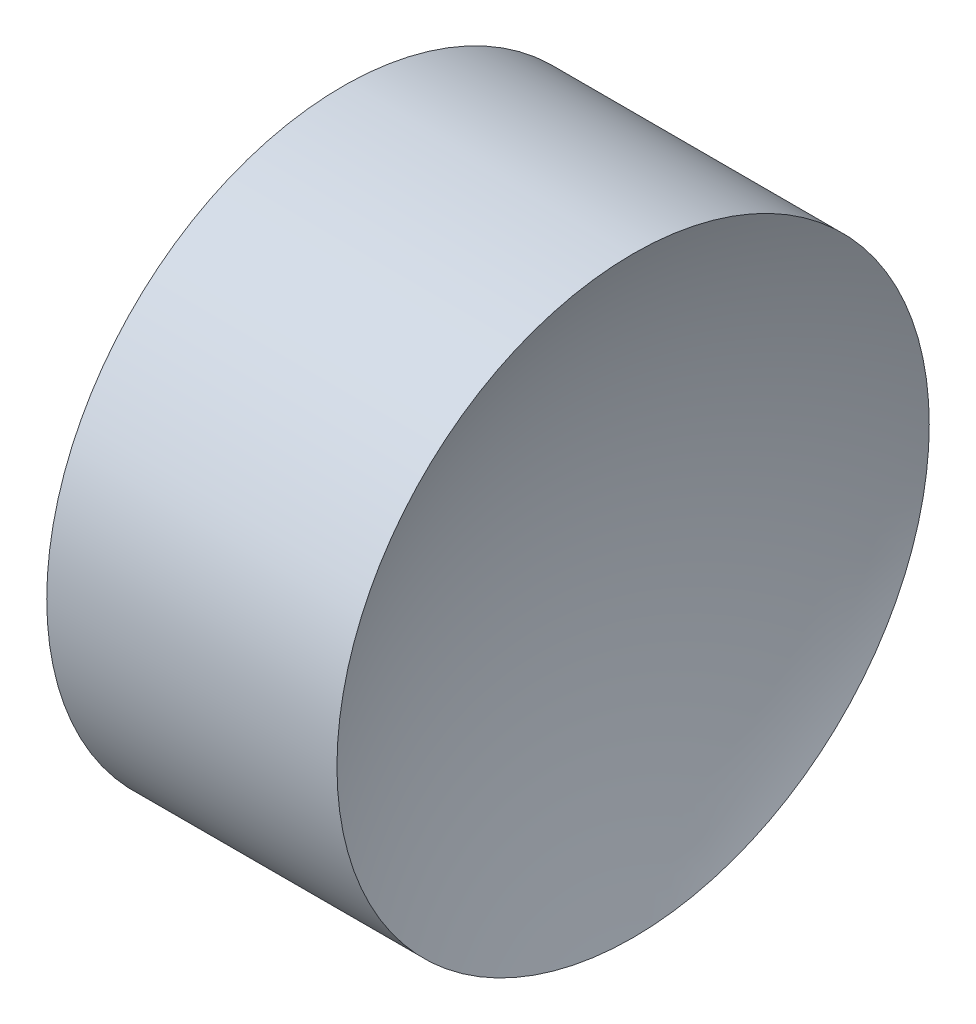
ISO-10303-21;
HEADER;
FILE_DESCRIPTION(('STEP AP214'),'2;1');
FILE_NAME('part.step','',(''),(''),'','','');
FILE_SCHEMA(('AUTOMOTIVE_DESIGN { 1 0 10303 214 1 1 1 1 }'));
ENDSEC;
DATA;
#1=APPLICATION_CONTEXT('core data for automotive mechanical design processes');
#2=APPLICATION_PROTOCOL_DEFINITION('international standard','automotive_design',2000,#1);
#3=PRODUCT_CONTEXT('',#1,'mechanical');
#4=PRODUCT('Part','Part','',(#3));
#5=PRODUCT_RELATED_PRODUCT_CATEGORY('part','',(#4));
#6=PRODUCT_DEFINITION_FORMATION('','',#4);
#7=PRODUCT_DEFINITION_CONTEXT('part definition',#1,'design');
#8=PRODUCT_DEFINITION('design','',#6,#7);
#9=PRODUCT_DEFINITION_SHAPE('','',#8);
#10=(LENGTH_UNIT() NAMED_UNIT(*) SI_UNIT(.MILLI.,.METRE.));
#11=(NAMED_UNIT(*) PLANE_ANGLE_UNIT() SI_UNIT($,.RADIAN.));
#12=(NAMED_UNIT(*) SI_UNIT($,.STERADIAN.) SOLID_ANGLE_UNIT());
#13=UNCERTAINTY_MEASURE_WITH_UNIT(LENGTH_MEASURE(1.E-05),#10,'distance_accuracy_value','');
#14=(GEOMETRIC_REPRESENTATION_CONTEXT(3) GLOBAL_UNCERTAINTY_ASSIGNED_CONTEXT((#13)) GLOBAL_UNIT_ASSIGNED_CONTEXT((#10,
#11,#12)) REPRESENTATION_CONTEXT('',''));
#15=CARTESIAN_POINT('',(0.,0.,0.));
#16=DIRECTION('',(0.,0.,1.));
#17=DIRECTION('',(1.,0.,0.));
#18=AXIS2_PLACEMENT_3D('',#15,#16,#17);
#19=CARTESIAN_POINT('',(17.160595084783,6.51556304570152,0.));
#20=DIRECTION('',(-1.,0.,0.));
#21=DIRECTION('',(0.,1.,0.));
#22=AXIS2_PLACEMENT_3D('',#19,#20,#21);
#23=SPHERICAL_SURFACE('',#22,4.58);
#24=CARTESIAN_POINT('',(13.0403523734855,6.51556304570152,0.));
#25=DIRECTION('',(-1.,0.,0.));
#26=DIRECTION('',(0.,0.,1.));
#27=AXIS2_PLACEMENT_3D('',#24,#25,#26);
#28=CIRCLE('',#27,2.);
#29=CARTESIAN_POINT('',(13.0403523734855,6.51556304570152,2.));
#30=VERTEX_POINT('',#29);
#31=EDGE_CURVE('E10',#30,#30,#28,.T.);
#32=ORIENTED_EDGE('',*,*,#31,.F.);
#33=EDGE_LOOP('',(#32));
#34=FACE_BOUND('',#33,.T.);
#35=ADVANCED_FACE('F35',(#34),#23,.F.);
#36=CARTESIAN_POINT('',(10.5782359612221,6.51556304570152,0.));
#37=DIRECTION('',(-1.,0.,0.));
#38=DIRECTION('',(0.,0.,1.));
#39=AXIS2_PLACEMENT_3D('',#36,#37,#38);
#40=CYLINDRICAL_SURFACE('',#39,2.);
#41=CARTESIAN_POINT('',(11.080595084783,6.51556304570152,0.));
#42=DIRECTION('',(-1.,0.,0.));
#43=DIRECTION('',(0.,0.,1.));
#44=AXIS2_PLACEMENT_3D('',#41,#42,#43);
#45=CIRCLE('',#44,2.);
#46=CARTESIAN_POINT('',(11.080595084783,6.51556304570152,2.));
#47=VERTEX_POINT('',#46);
#48=EDGE_CURVE('E41',#47,#47,#45,.T.);
#49=ORIENTED_EDGE('',*,*,#48,.F.);
#50=EDGE_LOOP('',(#49));
#51=FACE_BOUND('',#50,.T.);
#52=ORIENTED_EDGE('',*,*,#31,.T.);
#53=EDGE_LOOP('',(#52));
#54=FACE_BOUND('',#53,.T.);
#55=ADVANCED_FACE('F49',(#51,#54),#40,.T.);
#56=CARTESIAN_POINT('',(11.080595084783,6.51556304570152,0.));
#57=DIRECTION('',(1.,0.,0.));
#58=DIRECTION('',(0.,0.,-1.));
#59=AXIS2_PLACEMENT_3D('',#56,#57,#58);
#60=PLANE('',#59);
#61=ORIENTED_EDGE('',*,*,#48,.T.);
#62=EDGE_LOOP('',(#61));
#63=FACE_BOUND('',#62,.T.);
#64=ADVANCED_FACE('F47',(#63),#60,.F.);
#65=CLOSED_SHELL('',(#35,#55,#64));
#66=MANIFOLD_SOLID_BREP('B2',#65);
#67=ADVANCED_BREP_SHAPE_REPRESENTATION('',(#18,#66),#14);
#68=SHAPE_DEFINITION_REPRESENTATION(#9,#67);
ENDSEC;
END-ISO-10303-21;
